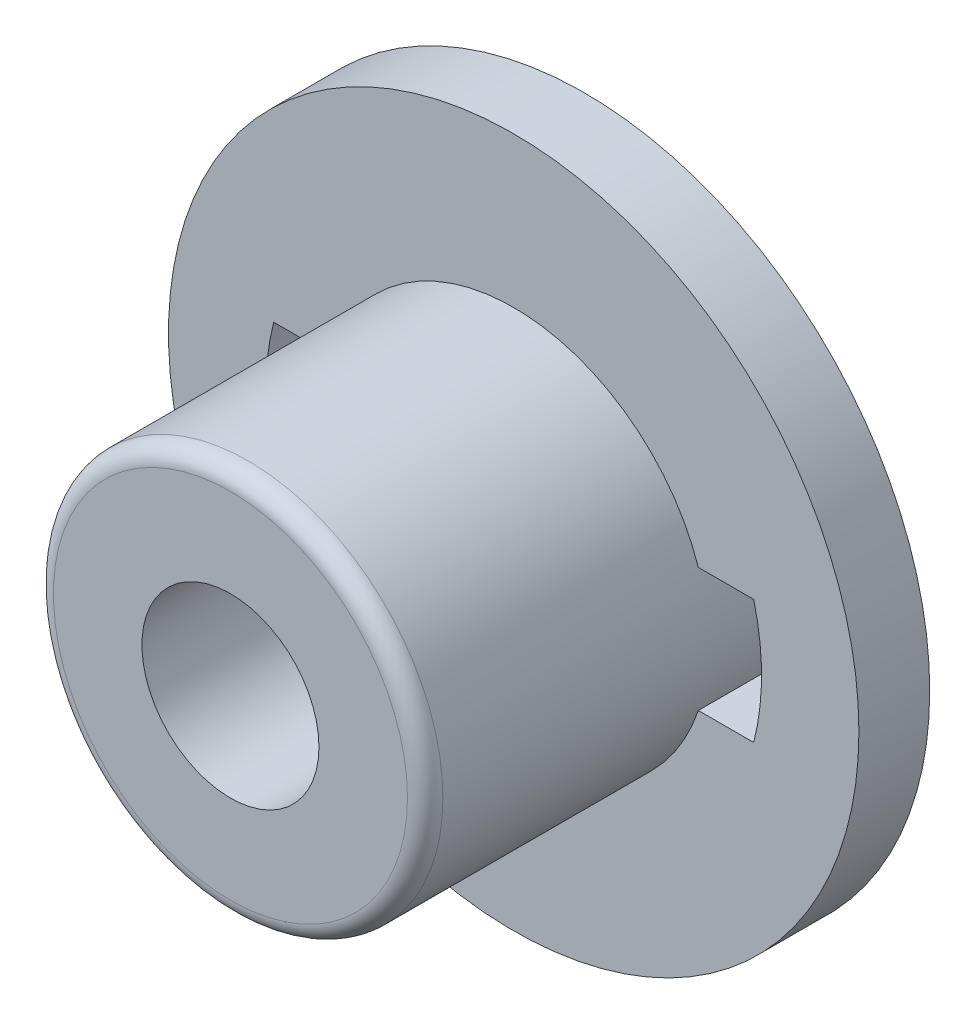
ISO-10303-21;
HEADER;
FILE_DESCRIPTION(('STEP AP214'),'2;1');
FILE_NAME('part.step','',(''),(''),'','','');
FILE_SCHEMA(('AUTOMOTIVE_DESIGN { 1 0 10303 214 1 1 1 1 }'));
ENDSEC;
DATA;
#1=APPLICATION_CONTEXT('core data for automotive mechanical design processes');
#2=APPLICATION_PROTOCOL_DEFINITION('international standard','automotive_design',2000,#1);
#3=PRODUCT_CONTEXT('',#1,'mechanical');
#4=PRODUCT('Part','Part','',(#3));
#5=PRODUCT_RELATED_PRODUCT_CATEGORY('part','',(#4));
#6=PRODUCT_DEFINITION_FORMATION('','',#4);
#7=PRODUCT_DEFINITION_CONTEXT('part definition',#1,'design');
#8=PRODUCT_DEFINITION('design','',#6,#7);
#9=PRODUCT_DEFINITION_SHAPE('','',#8);
#10=(LENGTH_UNIT() NAMED_UNIT(*) SI_UNIT(.MILLI.,.METRE.));
#11=(NAMED_UNIT(*) PLANE_ANGLE_UNIT() SI_UNIT($,.RADIAN.));
#12=(NAMED_UNIT(*) SI_UNIT($,.STERADIAN.) SOLID_ANGLE_UNIT());
#13=UNCERTAINTY_MEASURE_WITH_UNIT(LENGTH_MEASURE(1.E-05),#10,'distance_accuracy_value','');
#14=(GEOMETRIC_REPRESENTATION_CONTEXT(3) GLOBAL_UNCERTAINTY_ASSIGNED_CONTEXT((#13)) GLOBAL_UNIT_ASSIGNED_CONTEXT((#10,
#11,#12)) REPRESENTATION_CONTEXT('',''));
#15=CARTESIAN_POINT('',(0.,0.,0.));
#16=DIRECTION('',(0.,0.,1.));
#17=DIRECTION('',(1.,0.,0.));
#18=AXIS2_PLACEMENT_3D('',#15,#16,#17);
#19=CARTESIAN_POINT('',(0.,0.,-0.8));
#20=DIRECTION('',(0.,0.,1.));
#21=DIRECTION('',(1.,0.,0.));
#22=AXIS2_PLACEMENT_3D('',#19,#20,#21);
#23=PLANE('',#22);
#24=CARTESIAN_POINT('',(0.,0.,-0.8));
#25=DIRECTION('',(0.,0.,-1.));
#26=DIRECTION('',(-1.,0.,0.));
#27=AXIS2_PLACEMENT_3D('',#24,#25,#26);
#28=CIRCLE('',#27,2.2);
#29=CARTESIAN_POINT('',(2.08566536146142,0.7,-0.8));
#30=VERTEX_POINT('',#29);
#31=CARTESIAN_POINT('',(2.08566536146142,-0.7,-0.8));
#32=VERTEX_POINT('',#31);
#33=EDGE_CURVE('E203',#30,#32,#28,.T.);
#34=ORIENTED_EDGE('',*,*,#33,.T.);
#35=DIRECTION('',(-1.,0.,0.));
#36=VECTOR('',#35,1.);
#37=CARTESIAN_POINT('',(0.,-0.7,-0.8));
#38=LINE('',#37,#36);
#39=CARTESIAN_POINT('',(2.71108834234519,-0.7,-0.8));
#40=VERTEX_POINT('',#39);
#41=EDGE_CURVE('E211',#40,#32,#38,.T.);
#42=ORIENTED_EDGE('',*,*,#41,.F.);
#43=CARTESIAN_POINT('',(0.,0.,-0.8));
#44=DIRECTION('',(0.,0.,-1.));
#45=DIRECTION('',(-1.,0.,0.));
#46=AXIS2_PLACEMENT_3D('',#43,#44,#45);
#47=CIRCLE('',#46,2.8);
#48=CARTESIAN_POINT('',(2.71108834234519,0.7,-0.8));
#49=VERTEX_POINT('',#48);
#50=EDGE_CURVE('E208',#49,#40,#47,.T.);
#51=ORIENTED_EDGE('',*,*,#50,.F.);
#52=DIRECTION('',(-1.,0.,0.));
#53=VECTOR('',#52,1.);
#54=CARTESIAN_POINT('',(0.,0.7,-0.8));
#55=LINE('',#54,#53);
#56=EDGE_CURVE('E205',#49,#30,#55,.T.);
#57=ORIENTED_EDGE('',*,*,#56,.T.);
#58=EDGE_LOOP('',(#34,#42,#51,#57));
#59=FACE_BOUND('',#58,.T.);
#60=CARTESIAN_POINT('',(0.,0.,-0.8));
#61=DIRECTION('',(0.,0.,-1.));
#62=DIRECTION('',(-1.,0.,0.));
#63=AXIS2_PLACEMENT_3D('',#60,#61,#62);
#64=CIRCLE('',#63,1.15);
#65=CARTESIAN_POINT('',(-1.15,0.,-0.8));
#66=VERTEX_POINT('',#65);
#67=EDGE_CURVE('E223',#66,#66,#64,.T.);
#68=ORIENTED_EDGE('',*,*,#67,.F.);
#69=EDGE_LOOP('',(#68));
#70=FACE_BOUND('',#69,.T.);
#71=CARTESIAN_POINT('',(0.,0.,-0.8));
#72=DIRECTION('',(0.,0.,1.));
#73=DIRECTION('',(1.,0.,0.));
#74=AXIS2_PLACEMENT_3D('',#71,#72,#73);
#75=CIRCLE('',#74,3.9);
#76=CARTESIAN_POINT('',(3.9,0.,-0.8));
#77=VERTEX_POINT('',#76);
#78=EDGE_CURVE('E130',#77,#77,#75,.T.);
#79=ORIENTED_EDGE('',*,*,#78,.F.);
#80=EDGE_LOOP('',(#79));
#81=FACE_BOUND('',#80,.T.);
#82=CARTESIAN_POINT('',(0.,0.,-0.8));
#83=DIRECTION('',(0.,0.,-1.));
#84=DIRECTION('',(-1.,0.,0.));
#85=AXIS2_PLACEMENT_3D('',#82,#83,#84);
#86=CIRCLE('',#85,2.2);
#87=CARTESIAN_POINT('',(-2.08566536146142,-0.7,-0.8));
#88=VERTEX_POINT('',#87);
#89=CARTESIAN_POINT('',(-2.08566536146142,0.7,-0.8));
#90=VERTEX_POINT('',#89);
#91=EDGE_CURVE('E51',#88,#90,#86,.T.);
#92=ORIENTED_EDGE('',*,*,#91,.T.);
#93=DIRECTION('',(-1.,0.,0.));
#94=VECTOR('',#93,1.);
#95=CARTESIAN_POINT('',(0.,0.7,-0.8));
#96=LINE('',#95,#94);
#97=CARTESIAN_POINT('',(-2.71108834234519,0.7,-0.8));
#98=VERTEX_POINT('',#97);
#99=EDGE_CURVE('E104',#90,#98,#96,.T.);
#100=ORIENTED_EDGE('',*,*,#99,.T.);
#101=CARTESIAN_POINT('',(0.,0.,-0.8));
#102=DIRECTION('',(0.,0.,-1.));
#103=DIRECTION('',(-1.,0.,0.));
#104=AXIS2_PLACEMENT_3D('',#101,#102,#103);
#105=CIRCLE('',#104,2.8);
#106=CARTESIAN_POINT('',(-2.71108834234519,-0.7,-0.8));
#107=VERTEX_POINT('',#106);
#108=EDGE_CURVE('E185',#107,#98,#105,.T.);
#109=ORIENTED_EDGE('',*,*,#108,.F.);
#110=DIRECTION('',(-1.,0.,0.));
#111=VECTOR('',#110,1.);
#112=CARTESIAN_POINT('',(0.,-0.7,-0.8));
#113=LINE('',#112,#111);
#114=EDGE_CURVE('E183',#88,#107,#113,.T.);
#115=ORIENTED_EDGE('',*,*,#114,.F.);
#116=EDGE_LOOP('',(#92,#100,#109,#115));
#117=FACE_BOUND('',#116,.T.);
#118=ADVANCED_FACE('F35',(#59,#70,#81,#117),#23,.F.);
#119=CARTESIAN_POINT('',(0.,0.,0.));
#120=DIRECTION('',(0.,0.,1.));
#121=DIRECTION('',(1.,0.,0.));
#122=AXIS2_PLACEMENT_3D('',#119,#120,#121);
#123=PLANE('',#122);
#124=CARTESIAN_POINT('',(0.,0.,0.));
#125=DIRECTION('',(0.,0.,1.));
#126=DIRECTION('',(1.,0.,0.));
#127=AXIS2_PLACEMENT_3D('',#124,#125,#126);
#128=CIRCLE('',#127,3.9);
#129=CARTESIAN_POINT('',(3.9,0.,0.));
#130=VERTEX_POINT('',#129);
#131=EDGE_CURVE('E126',#130,#130,#128,.T.);
#132=ORIENTED_EDGE('',*,*,#131,.T.);
#133=EDGE_LOOP('',(#132));
#134=FACE_BOUND('',#133,.T.);
#135=CARTESIAN_POINT('',(0.,0.,0.));
#136=DIRECTION('',(0.,0.,1.));
#137=DIRECTION('',(1.,0.,0.));
#138=AXIS2_PLACEMENT_3D('',#135,#136,#137);
#139=CIRCLE('',#138,2.8);
#140=CARTESIAN_POINT('',(-2.71108834234519,-0.7,0.));
#141=VERTEX_POINT('',#140);
#142=CARTESIAN_POINT('',(-2.71108834234519,0.7,0.));
#143=VERTEX_POINT('',#142);
#144=EDGE_CURVE('E116',#141,#143,#139,.F.);
#145=ORIENTED_EDGE('',*,*,#144,.T.);
#146=DIRECTION('',(-1.,0.,0.));
#147=VECTOR('',#146,1.);
#148=CARTESIAN_POINT('',(0.,0.7,0.));
#149=LINE('',#148,#147);
#150=CARTESIAN_POINT('',(-2.08566536146142,0.7,0.));
#151=VERTEX_POINT('',#150);
#152=EDGE_CURVE('E101',#151,#143,#149,.T.);
#153=ORIENTED_EDGE('',*,*,#152,.F.);
#154=CARTESIAN_POINT('',(0.,0.,0.));
#155=DIRECTION('',(0.,0.,1.));
#156=DIRECTION('',(1.,0.,0.));
#157=AXIS2_PLACEMENT_3D('',#154,#155,#156);
#158=CIRCLE('',#157,2.2);
#159=CARTESIAN_POINT('',(2.08566536146142,0.7,0.));
#160=VERTEX_POINT('',#159);
#161=EDGE_CURVE('E114',#160,#151,#158,.T.);
#162=ORIENTED_EDGE('',*,*,#161,.F.);
#163=DIRECTION('',(-1.,0.,0.));
#164=VECTOR('',#163,1.);
#165=CARTESIAN_POINT('',(0.,0.7,0.));
#166=LINE('',#165,#164);
#167=CARTESIAN_POINT('',(2.71108834234519,0.7,0.));
#168=VERTEX_POINT('',#167);
#169=EDGE_CURVE('E216',#168,#160,#166,.T.);
#170=ORIENTED_EDGE('',*,*,#169,.F.);
#171=CARTESIAN_POINT('',(0.,0.,0.));
#172=DIRECTION('',(0.,0.,1.));
#173=DIRECTION('',(1.,0.,0.));
#174=AXIS2_PLACEMENT_3D('',#171,#172,#173);
#175=CIRCLE('',#174,2.8);
#176=CARTESIAN_POINT('',(2.71108834234519,-0.7,0.));
#177=VERTEX_POINT('',#176);
#178=EDGE_CURVE('E197',#168,#177,#175,.F.);
#179=ORIENTED_EDGE('',*,*,#178,.T.);
#180=DIRECTION('',(-1.,0.,0.));
#181=VECTOR('',#180,1.);
#182=CARTESIAN_POINT('',(0.,-0.7,0.));
#183=LINE('',#182,#181);
#184=CARTESIAN_POINT('',(2.08566536146142,-0.7,0.));
#185=VERTEX_POINT('',#184);
#186=EDGE_CURVE('E200',#177,#185,#183,.T.);
#187=ORIENTED_EDGE('',*,*,#186,.T.);
#188=CARTESIAN_POINT('',(-2.08566536146142,-0.7,0.));
#189=VERTEX_POINT('',#188);
#190=EDGE_CURVE('E123',#189,#185,#158,.T.);
#191=ORIENTED_EDGE('',*,*,#190,.F.);
#192=DIRECTION('',(-1.,0.,0.));
#193=VECTOR('',#192,1.);
#194=CARTESIAN_POINT('',(0.,-0.7,0.));
#195=LINE('',#194,#193);
#196=EDGE_CURVE('E106',#189,#141,#195,.T.);
#197=ORIENTED_EDGE('',*,*,#196,.T.);
#198=EDGE_LOOP('',(#145,#153,#162,#170,#179,#187,#191,#197));
#199=FACE_BOUND('',#198,.T.);
#200=ADVANCED_FACE('F112',(#134,#199),#123,.T.);
#201=CARTESIAN_POINT('',(0.,0.,-0.8));
#202=DIRECTION('',(0.,0.,1.));
#203=DIRECTION('',(1.,0.,0.));
#204=AXIS2_PLACEMENT_3D('',#201,#202,#203);
#205=CYLINDRICAL_SURFACE('',#204,1.);
#206=CARTESIAN_POINT('',(0.,0.,3.2));
#207=DIRECTION('',(0.,0.,1.));
#208=DIRECTION('',(1.,0.,0.));
#209=AXIS2_PLACEMENT_3D('',#206,#207,#208);
#210=CIRCLE('',#209,1.);
#211=CARTESIAN_POINT('',(1.,0.,3.2));
#212=VERTEX_POINT('',#211);
#213=EDGE_CURVE('E122',#212,#212,#210,.T.);
#214=ORIENTED_EDGE('',*,*,#213,.T.);
#215=EDGE_LOOP('',(#214));
#216=FACE_BOUND('',#215,.T.);
#217=CARTESIAN_POINT('',(0.,0.,-0.3));
#218=DIRECTION('',(0.,0.,-1.));
#219=DIRECTION('',(-1.,0.,0.));
#220=AXIS2_PLACEMENT_3D('',#217,#218,#219);
#221=CIRCLE('',#220,1.);
#222=CARTESIAN_POINT('',(-1.,0.,-0.3));
#223=VERTEX_POINT('',#222);
#224=EDGE_CURVE('E39',#223,#223,#221,.F.);
#225=ORIENTED_EDGE('',*,*,#224,.F.);
#226=EDGE_LOOP('',(#225));
#227=FACE_BOUND('',#226,.T.);
#228=ADVANCED_FACE('F159',(#216,#227),#205,.F.);
#229=CARTESIAN_POINT('',(0.,0.,-0.8));
#230=DIRECTION('',(0.,0.,1.));
#231=DIRECTION('',(1.,0.,0.));
#232=AXIS2_PLACEMENT_3D('',#229,#230,#231);
#233=CYLINDRICAL_SURFACE('',#232,3.9);
#234=ORIENTED_EDGE('',*,*,#78,.T.);
#235=EDGE_LOOP('',(#234));
#236=FACE_BOUND('',#235,.T.);
#237=ORIENTED_EDGE('',*,*,#131,.F.);
#238=EDGE_LOOP('',(#237));
#239=FACE_BOUND('',#238,.T.);
#240=ADVANCED_FACE('F167',(#236,#239),#233,.T.);
#241=CARTESIAN_POINT('',(0.,0.,3.2));
#242=DIRECTION('',(0.,0.,-1.));
#243=DIRECTION('',(-1.,0.,0.));
#244=AXIS2_PLACEMENT_3D('',#241,#242,#243);
#245=CYLINDRICAL_SURFACE('',#244,2.2);
#246=CARTESIAN_POINT('',(0.,0.,3.));
#247=DIRECTION('',(0.,0.,1.));
#248=DIRECTION('',(1.,0.,0.));
#249=AXIS2_PLACEMENT_3D('',#246,#247,#248);
#250=CIRCLE('',#249,2.2);
#251=CARTESIAN_POINT('',(2.2,0.,3.));
#252=VERTEX_POINT('',#251);
#253=EDGE_CURVE('E11',#252,#252,#250,.F.);
#254=ORIENTED_EDGE('',*,*,#253,.T.);
#255=EDGE_LOOP('',(#254));
#256=FACE_BOUND('',#255,.T.);
#257=ORIENTED_EDGE('',*,*,#161,.T.);
#258=DIRECTION('',(0.,0.,-1.));
#259=VECTOR('',#258,1.);
#260=CARTESIAN_POINT('',(-2.08566536146142,0.7,3.201));
#261=LINE('',#260,#259);
#262=EDGE_CURVE('E98',#151,#90,#261,.T.);
#263=ORIENTED_EDGE('',*,*,#262,.T.);
#264=ORIENTED_EDGE('',*,*,#91,.F.);
#265=DIRECTION('',(0.,0.,-1.));
#266=VECTOR('',#265,1.);
#267=CARTESIAN_POINT('',(-2.08566536146142,-0.7,3.201));
#268=LINE('',#267,#266);
#269=EDGE_CURVE('E55',#189,#88,#268,.T.);
#270=ORIENTED_EDGE('',*,*,#269,.F.);
#271=ORIENTED_EDGE('',*,*,#190,.T.);
#272=DIRECTION('',(0.,0.,-1.));
#273=VECTOR('',#272,1.);
#274=CARTESIAN_POINT('',(2.08566536146142,-0.7,3.201));
#275=LINE('',#274,#273);
#276=EDGE_CURVE('E214',#185,#32,#275,.T.);
#277=ORIENTED_EDGE('',*,*,#276,.T.);
#278=ORIENTED_EDGE('',*,*,#33,.F.);
#279=DIRECTION('',(0.,0.,-1.));
#280=VECTOR('',#279,1.);
#281=CARTESIAN_POINT('',(2.08566536146142,0.7,3.201));
#282=LINE('',#281,#280);
#283=EDGE_CURVE('E121',#160,#30,#282,.T.);
#284=ORIENTED_EDGE('',*,*,#283,.F.);
#285=EDGE_LOOP('',(#257,#263,#264,#270,#271,#277,#278,#284));
#286=FACE_BOUND('',#285,.T.);
#287=ADVANCED_FACE('F119',(#256,#286),#245,.T.);
#288=CARTESIAN_POINT('',(0.,0.,3.2));
#289=DIRECTION('',(0.,0.,1.));
#290=DIRECTION('',(1.,0.,0.));
#291=AXIS2_PLACEMENT_3D('',#288,#289,#290);
#292=PLANE('',#291);
#293=CARTESIAN_POINT('',(0.,0.,3.2));
#294=DIRECTION('',(0.,0.,1.));
#295=DIRECTION('',(1.,0.,0.));
#296=AXIS2_PLACEMENT_3D('',#293,#294,#295);
#297=CIRCLE('',#296,2.);
#298=CARTESIAN_POINT('',(2.,0.,3.2));
#299=VERTEX_POINT('',#298);
#300=EDGE_CURVE('E44',#299,#299,#297,.T.);
#301=ORIENTED_EDGE('',*,*,#300,.T.);
#302=EDGE_LOOP('',(#301));
#303=FACE_BOUND('',#302,.T.);
#304=ORIENTED_EDGE('',*,*,#213,.F.);
#305=EDGE_LOOP('',(#304));
#306=FACE_BOUND('',#305,.T.);
#307=ADVANCED_FACE('F138',(#303,#306),#292,.T.);
#308=CARTESIAN_POINT('',(0.,0.,3.));
#309=DIRECTION('',(0.,0.,1.));
#310=DIRECTION('',(1.,0.,0.));
#311=AXIS2_PLACEMENT_3D('',#308,#309,#310);
#312=TOROIDAL_SURFACE('',#311,2.,0.2);
#313=ORIENTED_EDGE('',*,*,#253,.F.);
#314=EDGE_LOOP('',(#313));
#315=FACE_BOUND('',#314,.T.);
#316=ORIENTED_EDGE('',*,*,#300,.F.);
#317=EDGE_LOOP('',(#316));
#318=FACE_BOUND('',#317,.T.);
#319=ADVANCED_FACE('F37',(#315,#318),#312,.T.);
#320=CARTESIAN_POINT('',(0.,0.,-0.3));
#321=DIRECTION('',(0.,0.,-1.));
#322=DIRECTION('',(-1.,0.,0.));
#323=AXIS2_PLACEMENT_3D('',#320,#321,#322);
#324=PLANE('',#323);
#325=CARTESIAN_POINT('',(0.,0.,-0.3));
#326=DIRECTION('',(0.,0.,-1.));
#327=DIRECTION('',(-1.,0.,0.));
#328=AXIS2_PLACEMENT_3D('',#325,#326,#327);
#329=CIRCLE('',#328,1.15);
#330=CARTESIAN_POINT('',(-1.15,0.,-0.3));
#331=VERTEX_POINT('',#330);
#332=EDGE_CURVE('E224',#331,#331,#329,.T.);
#333=ORIENTED_EDGE('',*,*,#332,.T.);
#334=EDGE_LOOP('',(#333));
#335=FACE_BOUND('',#334,.T.);
#336=ORIENTED_EDGE('',*,*,#224,.T.);
#337=EDGE_LOOP('',(#336));
#338=FACE_BOUND('',#337,.T.);
#339=ADVANCED_FACE('F142',(#335,#338),#324,.T.);
#340=CARTESIAN_POINT('',(0.,0.,-0.3));
#341=DIRECTION('',(0.,0.,-1.));
#342=DIRECTION('',(-1.,0.,0.));
#343=AXIS2_PLACEMENT_3D('',#340,#341,#342);
#344=CYLINDRICAL_SURFACE('',#343,1.15);
#345=ORIENTED_EDGE('',*,*,#332,.F.);
#346=EDGE_LOOP('',(#345));
#347=FACE_BOUND('',#346,.T.);
#348=ORIENTED_EDGE('',*,*,#67,.T.);
#349=EDGE_LOOP('',(#348));
#350=FACE_BOUND('',#349,.T.);
#351=ADVANCED_FACE('F148',(#347,#350),#344,.F.);
#352=CARTESIAN_POINT('',(0.,-0.7,3.201));
#353=DIRECTION('',(0.,-1.,0.));
#354=DIRECTION('',(0.,0.,-1.));
#355=AXIS2_PLACEMENT_3D('',#352,#353,#354);
#356=PLANE('',#355);
#357=DIRECTION('',(0.,0.,-1.));
#358=VECTOR('',#357,1.);
#359=CARTESIAN_POINT('',(2.71108834234519,-0.7,3.201));
#360=LINE('',#359,#358);
#361=EDGE_CURVE('E217',#177,#40,#360,.T.);
#362=ORIENTED_EDGE('',*,*,#361,.T.);
#363=ORIENTED_EDGE('',*,*,#41,.T.);
#364=ORIENTED_EDGE('',*,*,#276,.F.);
#365=ORIENTED_EDGE('',*,*,#186,.F.);
#366=EDGE_LOOP('',(#362,#363,#364,#365));
#367=FACE_BOUND('',#366,.T.);
#368=ADVANCED_FACE('F230',(#367),#356,.F.);
#369=CARTESIAN_POINT('',(0.,0.,3.201));
#370=DIRECTION('',(0.,0.,-1.));
#371=DIRECTION('',(-1.,0.,0.));
#372=AXIS2_PLACEMENT_3D('',#369,#370,#371);
#373=CYLINDRICAL_SURFACE('',#372,2.8);
#374=DIRECTION('',(0.,0.,-1.));
#375=VECTOR('',#374,1.);
#376=CARTESIAN_POINT('',(2.71108834234519,0.7,3.201));
#377=LINE('',#376,#375);
#378=EDGE_CURVE('E219',#168,#49,#377,.T.);
#379=ORIENTED_EDGE('',*,*,#378,.T.);
#380=ORIENTED_EDGE('',*,*,#50,.T.);
#381=ORIENTED_EDGE('',*,*,#361,.F.);
#382=ORIENTED_EDGE('',*,*,#178,.F.);
#383=EDGE_LOOP('',(#379,#380,#381,#382));
#384=FACE_BOUND('',#383,.T.);
#385=ADVANCED_FACE('F236',(#384),#373,.F.);
#386=CARTESIAN_POINT('',(0.,0.7,3.201));
#387=DIRECTION('',(0.,-1.,0.));
#388=DIRECTION('',(0.,0.,-1.));
#389=AXIS2_PLACEMENT_3D('',#386,#387,#388);
#390=PLANE('',#389);
#391=ORIENTED_EDGE('',*,*,#169,.T.);
#392=ORIENTED_EDGE('',*,*,#283,.T.);
#393=ORIENTED_EDGE('',*,*,#56,.F.);
#394=ORIENTED_EDGE('',*,*,#378,.F.);
#395=EDGE_LOOP('',(#391,#392,#393,#394));
#396=FACE_BOUND('',#395,.T.);
#397=ADVANCED_FACE('F241',(#396),#390,.T.);
#398=CARTESIAN_POINT('',(0.,0.7,3.201));
#399=DIRECTION('',(0.,-1.,0.));
#400=DIRECTION('',(0.,0.,-1.));
#401=AXIS2_PLACEMENT_3D('',#398,#399,#400);
#402=PLANE('',#401);
#403=ORIENTED_EDGE('',*,*,#152,.T.);
#404=DIRECTION('',(0.,0.,-1.));
#405=VECTOR('',#404,1.);
#406=CARTESIAN_POINT('',(-2.71108834234519,0.7,3.201));
#407=LINE('',#406,#405);
#408=EDGE_CURVE('E107',#143,#98,#407,.T.);
#409=ORIENTED_EDGE('',*,*,#408,.T.);
#410=ORIENTED_EDGE('',*,*,#99,.F.);
#411=ORIENTED_EDGE('',*,*,#262,.F.);
#412=EDGE_LOOP('',(#403,#409,#410,#411));
#413=FACE_BOUND('',#412,.T.);
#414=ADVANCED_FACE('F100',(#413),#402,.T.);
#415=CARTESIAN_POINT('',(0.,0.,3.201));
#416=DIRECTION('',(0.,0.,-1.));
#417=DIRECTION('',(-1.,0.,0.));
#418=AXIS2_PLACEMENT_3D('',#415,#416,#417);
#419=CYLINDRICAL_SURFACE('',#418,2.8);
#420=DIRECTION('',(0.,0.,-1.));
#421=VECTOR('',#420,1.);
#422=CARTESIAN_POINT('',(-2.71108834234519,-0.7,3.201));
#423=LINE('',#422,#421);
#424=EDGE_CURVE('E193',#141,#107,#423,.T.);
#425=ORIENTED_EDGE('',*,*,#424,.T.);
#426=ORIENTED_EDGE('',*,*,#108,.T.);
#427=ORIENTED_EDGE('',*,*,#408,.F.);
#428=ORIENTED_EDGE('',*,*,#144,.F.);
#429=EDGE_LOOP('',(#425,#426,#427,#428));
#430=FACE_BOUND('',#429,.T.);
#431=ADVANCED_FACE('F251',(#430),#419,.F.);
#432=CARTESIAN_POINT('',(0.,-0.7,3.201));
#433=DIRECTION('',(0.,-1.,0.));
#434=DIRECTION('',(0.,0.,-1.));
#435=AXIS2_PLACEMENT_3D('',#432,#433,#434);
#436=PLANE('',#435);
#437=ORIENTED_EDGE('',*,*,#269,.T.);
#438=ORIENTED_EDGE('',*,*,#114,.T.);
#439=ORIENTED_EDGE('',*,*,#424,.F.);
#440=ORIENTED_EDGE('',*,*,#196,.F.);
#441=EDGE_LOOP('',(#437,#438,#439,#440));
#442=FACE_BOUND('',#441,.T.);
#443=ADVANCED_FACE('F248',(#442),#436,.F.);
#444=CLOSED_SHELL('',(#118,#200,#228,#240,#287,#307,#319,#339,#351,#368,#385,#397,#414,#431,#443));
#445=MANIFOLD_SOLID_BREP('B2',#444);
#446=ADVANCED_BREP_SHAPE_REPRESENTATION('',(#18,#445),#14);
#447=SHAPE_DEFINITION_REPRESENTATION(#9,#446);
ENDSEC;
END-ISO-10303-21;
